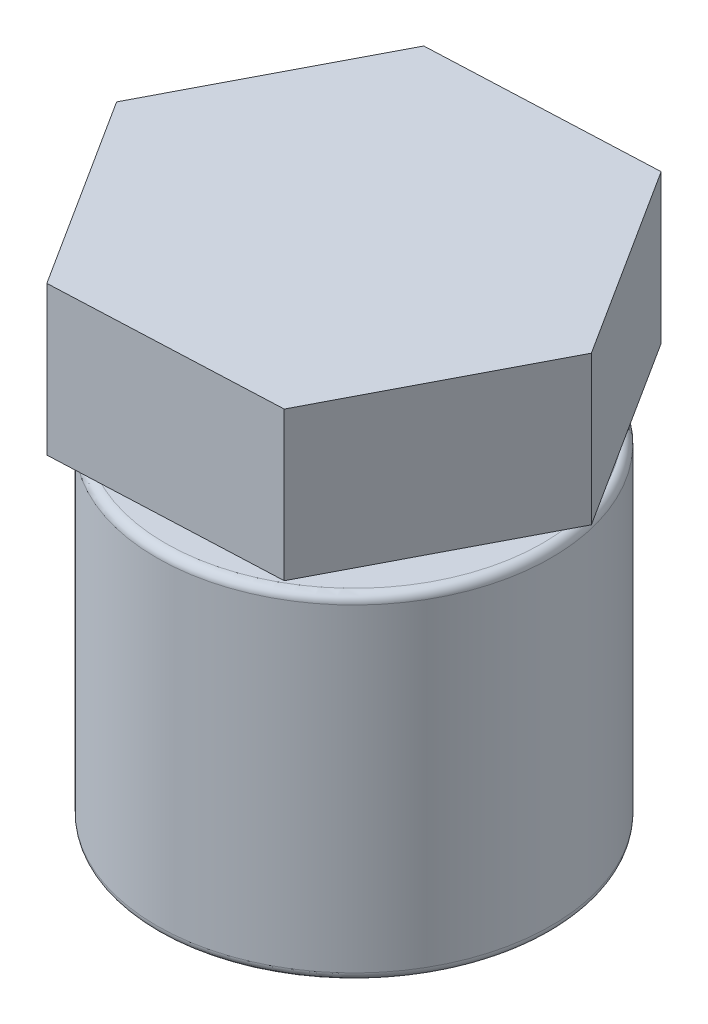
ISO-10303-21;
HEADER;
FILE_DESCRIPTION(('STEP AP214'),'2;1');
FILE_NAME('part.step','',(''),(''),'','','');
FILE_SCHEMA(('AUTOMOTIVE_DESIGN { 1 0 10303 214 1 1 1 1 }'));
ENDSEC;
DATA;
#1=APPLICATION_CONTEXT('core data for automotive mechanical design processes');
#2=APPLICATION_PROTOCOL_DEFINITION('international standard','automotive_design',2000,#1);
#3=PRODUCT_CONTEXT('',#1,'mechanical');
#4=PRODUCT('Part','Part','',(#3));
#5=PRODUCT_RELATED_PRODUCT_CATEGORY('part','',(#4));
#6=PRODUCT_DEFINITION_FORMATION('','',#4);
#7=PRODUCT_DEFINITION_CONTEXT('part definition',#1,'design');
#8=PRODUCT_DEFINITION('design','',#6,#7);
#9=PRODUCT_DEFINITION_SHAPE('','',#8);
#10=(LENGTH_UNIT() NAMED_UNIT(*) SI_UNIT(.MILLI.,.METRE.));
#11=(NAMED_UNIT(*) PLANE_ANGLE_UNIT() SI_UNIT($,.RADIAN.));
#12=(NAMED_UNIT(*) SI_UNIT($,.STERADIAN.) SOLID_ANGLE_UNIT());
#13=UNCERTAINTY_MEASURE_WITH_UNIT(LENGTH_MEASURE(1.E-05),#10,'distance_accuracy_value','');
#14=(GEOMETRIC_REPRESENTATION_CONTEXT(3) GLOBAL_UNCERTAINTY_ASSIGNED_CONTEXT((#13)) GLOBAL_UNIT_ASSIGNED_CONTEXT((#10,
#11,#12)) REPRESENTATION_CONTEXT('',''));
#15=CARTESIAN_POINT('',(0.,0.,0.));
#16=DIRECTION('',(0.,0.,1.));
#17=DIRECTION('',(1.,0.,0.));
#18=AXIS2_PLACEMENT_3D('',#15,#16,#17);
#19=CARTESIAN_POINT('',(-24.7630057131424,64.9433169628855,47.5415775502644));
#20=DIRECTION('',(-0.0433808852223487,0.,-0.999058606287602));
#21=DIRECTION('',(-0.999058606287602,0.,0.0433808852223487));
#22=AXIS2_PLACEMENT_3D('',#19,#20,#21);
#23=PLANE('',#22);
#24=DIRECTION('',(0.999058606287602,0.,-0.0433808852223487));
#25=VECTOR('',#24,1.);
#26=CARTESIAN_POINT('',(-24.7630057131424,29.9433169628855,47.5415775502644));
#27=LINE('',#26,#25);
#28=CARTESIAN_POINT('',(-24.7630057131424,29.9433169628855,47.5415775502644));
#29=VERTEX_POINT('',#28);
#30=CARTESIAN_POINT('',(28.7907110379457,29.9433169628855,45.2161807967727));
#31=VERTEX_POINT('',#30);
#32=EDGE_CURVE('E138',#29,#31,#27,.T.);
#33=ORIENTED_EDGE('',*,*,#32,.T.);
#34=DIRECTION('',(0.,-1.,0.));
#35=VECTOR('',#34,1.);
#36=CARTESIAN_POINT('',(28.7907110379457,64.9433169628855,45.2161807967727));
#37=LINE('',#36,#35);
#38=CARTESIAN_POINT('',(28.7907110379457,64.9433169628855,45.2161807967727));
#39=VERTEX_POINT('',#38);
#40=EDGE_CURVE('E12',#39,#31,#37,.T.);
#41=ORIENTED_EDGE('',*,*,#40,.F.);
#42=DIRECTION('',(0.999058606287602,0.,-0.0433808852223487));
#43=VECTOR('',#42,1.);
#44=CARTESIAN_POINT('',(-24.7630057131424,64.9433169628855,47.5415775502644));
#45=LINE('',#44,#43);
#46=CARTESIAN_POINT('',(-24.7630057131424,64.9433169628855,47.5415775502644));
#47=VERTEX_POINT('',#46);
#48=EDGE_CURVE('E155',#47,#39,#45,.T.);
#49=ORIENTED_EDGE('',*,*,#48,.F.);
#50=DIRECTION('',(0.,-1.,0.));
#51=VECTOR('',#50,1.);
#52=CARTESIAN_POINT('',(-24.7630057131424,64.9433169628855,47.5415775502644));
#53=LINE('',#52,#51);
#54=EDGE_CURVE('E134',#47,#29,#53,.T.);
#55=ORIENTED_EDGE('',*,*,#54,.T.);
#56=EDGE_LOOP('',(#33,#41,#49,#55));
#57=FACE_BOUND('',#56,.T.);
#58=ADVANCED_FACE('F49',(#57),#23,.F.);
#59=CARTESIAN_POINT('',(28.7907110379457,64.9433169628855,45.2161807967727));
#60=DIRECTION('',(-0.886900575525713,0.,-0.46196035450259));
#61=DIRECTION('',(-0.46196035450259,0.,0.886900575525714));
#62=AXIS2_PLACEMENT_3D('',#59,#60,#61);
#63=PLANE('',#62);
#64=DIRECTION('',(0.46196035450259,0.,-0.886900575525713));
#65=VECTOR('',#64,1.);
#66=CARTESIAN_POINT('',(28.7907110379457,29.9433169628855,45.2161807967727));
#67=LINE('',#66,#65);
#68=CARTESIAN_POINT('',(53.5537167510881,29.9433169628855,-2.32539675349171));
#69=VERTEX_POINT('',#68);
#70=EDGE_CURVE('E142',#31,#69,#67,.T.);
#71=ORIENTED_EDGE('',*,*,#70,.T.);
#72=DIRECTION('',(0.,-1.,0.));
#73=VECTOR('',#72,1.);
#74=CARTESIAN_POINT('',(53.5537167510881,64.9433169628855,-2.32539675349171));
#75=LINE('',#74,#73);
#76=CARTESIAN_POINT('',(53.5537167510881,64.9433169628855,-2.32539675349171));
#77=VERTEX_POINT('',#76);
#78=EDGE_CURVE('E58',#77,#69,#75,.T.);
#79=ORIENTED_EDGE('',*,*,#78,.F.);
#80=DIRECTION('',(0.46196035450259,0.,-0.886900575525713));
#81=VECTOR('',#80,1.);
#82=CARTESIAN_POINT('',(28.7907110379457,64.9433169628855,45.2161807967727));
#83=LINE('',#82,#81);
#84=EDGE_CURVE('E103',#39,#77,#83,.T.);
#85=ORIENTED_EDGE('',*,*,#84,.F.);
#86=ORIENTED_EDGE('',*,*,#40,.T.);
#87=EDGE_LOOP('',(#71,#79,#85,#86));
#88=FACE_BOUND('',#87,.T.);
#89=ADVANCED_FACE('F184',(#88),#63,.F.);
#90=CARTESIAN_POINT('',(53.5537167510881,64.9433169628855,-2.32539675349171));
#91=DIRECTION('',(-0.843519690303365,0.,0.537098251785012));
#92=DIRECTION('',(0.537098251785012,0.,0.843519690303365));
#93=AXIS2_PLACEMENT_3D('',#90,#91,#92);
#94=PLANE('',#93);
#95=DIRECTION('',(-0.537098251785012,0.,-0.843519690303364));
#96=VECTOR('',#95,1.);
#97=CARTESIAN_POINT('',(53.5537167510881,29.9433169628855,-2.32539675349171));
#98=LINE('',#97,#96);
#99=CARTESIAN_POINT('',(24.7630057131424,29.9433169628855,-47.5415775502644));
#100=VERTEX_POINT('',#99);
#101=EDGE_CURVE('E146',#69,#100,#98,.T.);
#102=ORIENTED_EDGE('',*,*,#101,.T.);
#103=DIRECTION('',(0.,-1.,0.));
#104=VECTOR('',#103,1.);
#105=CARTESIAN_POINT('',(24.7630057131424,64.9433169628855,-47.5415775502644));
#106=LINE('',#105,#104);
#107=CARTESIAN_POINT('',(24.7630057131424,64.9433169628855,-47.5415775502644));
#108=VERTEX_POINT('',#107);
#109=EDGE_CURVE('E127',#108,#100,#106,.T.);
#110=ORIENTED_EDGE('',*,*,#109,.F.);
#111=DIRECTION('',(-0.537098251785012,0.,-0.843519690303364));
#112=VECTOR('',#111,1.);
#113=CARTESIAN_POINT('',(53.5537167510881,64.9433169628855,-2.32539675349171));
#114=LINE('',#113,#112);
#115=EDGE_CURVE('E116',#77,#108,#114,.T.);
#116=ORIENTED_EDGE('',*,*,#115,.F.);
#117=ORIENTED_EDGE('',*,*,#78,.T.);
#118=EDGE_LOOP('',(#102,#110,#116,#117));
#119=FACE_BOUND('',#118,.T.);
#120=ADVANCED_FACE('F165',(#119),#94,.F.);
#121=CARTESIAN_POINT('',(24.7630057131424,64.9433169628855,-47.5415775502644));
#122=DIRECTION('',(0.0433808852223485,0.,0.999058606287602));
#123=DIRECTION('',(0.999058606287602,0.,-0.0433808852223485));
#124=AXIS2_PLACEMENT_3D('',#121,#122,#123);
#125=PLANE('',#124);
#126=DIRECTION('',(-0.999058606287602,0.,0.0433808852223485));
#127=VECTOR('',#126,1.);
#128=CARTESIAN_POINT('',(24.7630057131424,29.9433169628855,-47.5415775502644));
#129=LINE('',#128,#127);
#130=CARTESIAN_POINT('',(-28.7907110379457,29.9433169628855,-45.2161807967727));
#131=VERTEX_POINT('',#130);
#132=EDGE_CURVE('E125',#100,#131,#129,.T.);
#133=ORIENTED_EDGE('',*,*,#132,.T.);
#134=DIRECTION('',(0.,-1.,0.));
#135=VECTOR('',#134,1.);
#136=CARTESIAN_POINT('',(-28.7907110379457,64.9433169628855,-45.2161807967727));
#137=LINE('',#136,#135);
#138=CARTESIAN_POINT('',(-28.7907110379457,64.9433169628855,-45.2161807967727));
#139=VERTEX_POINT('',#138);
#140=EDGE_CURVE('E122',#139,#131,#137,.T.);
#141=ORIENTED_EDGE('',*,*,#140,.F.);
#142=DIRECTION('',(-0.999058606287602,0.,0.0433808852223485));
#143=VECTOR('',#142,1.);
#144=CARTESIAN_POINT('',(24.7630057131424,64.9433169628855,-47.5415775502644));
#145=LINE('',#144,#143);
#146=EDGE_CURVE('E110',#108,#139,#145,.T.);
#147=ORIENTED_EDGE('',*,*,#146,.F.);
#148=ORIENTED_EDGE('',*,*,#109,.T.);
#149=EDGE_LOOP('',(#133,#141,#147,#148));
#150=FACE_BOUND('',#149,.T.);
#151=ADVANCED_FACE('F123',(#150),#125,.F.);
#152=CARTESIAN_POINT('',(-28.7907110379457,64.9433169628855,-45.2161807967727));
#153=DIRECTION('',(0.886900575525713,0.,0.46196035450259));
#154=DIRECTION('',(0.46196035450259,0.,-0.886900575525713));
#155=AXIS2_PLACEMENT_3D('',#152,#153,#154);
#156=PLANE('',#155);
#157=DIRECTION('',(-0.46196035450259,0.,0.886900575525713));
#158=VECTOR('',#157,1.);
#159=CARTESIAN_POINT('',(-28.7907110379457,29.9433169628855,-45.2161807967727));
#160=LINE('',#159,#158);
#161=CARTESIAN_POINT('',(-53.5537167510881,29.9433169628855,2.3253967534917));
#162=VERTEX_POINT('',#161);
#163=EDGE_CURVE('E89',#131,#162,#160,.T.);
#164=ORIENTED_EDGE('',*,*,#163,.T.);
#165=DIRECTION('',(0.,-1.,0.));
#166=VECTOR('',#165,1.);
#167=CARTESIAN_POINT('',(-53.5537167510881,64.9433169628855,2.3253967534917));
#168=LINE('',#167,#166);
#169=CARTESIAN_POINT('',(-53.5537167510881,64.9433169628855,2.3253967534917));
#170=VERTEX_POINT('',#169);
#171=EDGE_CURVE('E128',#170,#162,#168,.T.);
#172=ORIENTED_EDGE('',*,*,#171,.F.);
#173=DIRECTION('',(-0.46196035450259,0.,0.886900575525713));
#174=VECTOR('',#173,1.);
#175=CARTESIAN_POINT('',(-28.7907110379457,64.9433169628855,-45.2161807967727));
#176=LINE('',#175,#174);
#177=EDGE_CURVE('E114',#139,#170,#176,.T.);
#178=ORIENTED_EDGE('',*,*,#177,.F.);
#179=ORIENTED_EDGE('',*,*,#140,.T.);
#180=EDGE_LOOP('',(#164,#172,#178,#179));
#181=FACE_BOUND('',#180,.T.);
#182=ADVANCED_FACE('F130',(#181),#156,.F.);
#183=CARTESIAN_POINT('',(-53.5537167510881,64.9433169628855,2.3253967534917));
#184=DIRECTION('',(0.843519690303365,0.,-0.537098251785012));
#185=DIRECTION('',(-0.537098251785012,0.,-0.843519690303365));
#186=AXIS2_PLACEMENT_3D('',#183,#184,#185);
#187=PLANE('',#186);
#188=DIRECTION('',(0.537098251785012,0.,0.843519690303365));
#189=VECTOR('',#188,1.);
#190=CARTESIAN_POINT('',(-53.5537167510881,29.9433169628855,2.3253967534917));
#191=LINE('',#190,#189);
#192=EDGE_CURVE('E95',#162,#29,#191,.T.);
#193=ORIENTED_EDGE('',*,*,#192,.T.);
#194=ORIENTED_EDGE('',*,*,#54,.F.);
#195=DIRECTION('',(0.537098251785012,0.,0.843519690303365));
#196=VECTOR('',#195,1.);
#197=CARTESIAN_POINT('',(-53.5537167510881,64.9433169628855,2.3253967534917));
#198=LINE('',#197,#196);
#199=EDGE_CURVE('E66',#170,#47,#198,.T.);
#200=ORIENTED_EDGE('',*,*,#199,.F.);
#201=ORIENTED_EDGE('',*,*,#171,.T.);
#202=EDGE_LOOP('',(#193,#194,#200,#201));
#203=FACE_BOUND('',#202,.T.);
#204=ADVANCED_FACE('F173',(#203),#187,.F.);
#205=CARTESIAN_POINT('',(0.,64.9433169628855,0.));
#206=DIRECTION('',(0.,1.,0.));
#207=DIRECTION('',(0.,0.,1.));
#208=AXIS2_PLACEMENT_3D('',#205,#206,#207);
#209=PLANE('',#208);
#210=ORIENTED_EDGE('',*,*,#48,.T.);
#211=ORIENTED_EDGE('',*,*,#84,.T.);
#212=ORIENTED_EDGE('',*,*,#115,.T.);
#213=ORIENTED_EDGE('',*,*,#146,.T.);
#214=ORIENTED_EDGE('',*,*,#177,.T.);
#215=ORIENTED_EDGE('',*,*,#199,.T.);
#216=EDGE_LOOP('',(#210,#211,#212,#213,#214,#215));
#217=FACE_BOUND('',#216,.T.);
#218=ADVANCED_FACE('F112',(#217),#209,.T.);
#219=CARTESIAN_POINT('',(0.,29.9433169628855,0.));
#220=DIRECTION('',(0.,1.,0.));
#221=DIRECTION('',(0.,0.,1.));
#222=AXIS2_PLACEMENT_3D('',#219,#220,#221);
#223=PLANE('',#222);
#224=ORIENTED_EDGE('',*,*,#32,.F.);
#225=ORIENTED_EDGE('',*,*,#192,.F.);
#226=ORIENTED_EDGE('',*,*,#163,.F.);
#227=ORIENTED_EDGE('',*,*,#132,.F.);
#228=ORIENTED_EDGE('',*,*,#101,.F.);
#229=ORIENTED_EDGE('',*,*,#70,.F.);
#230=EDGE_LOOP('',(#224,#225,#226,#227,#228,#229));
#231=FACE_BOUND('',#230,.T.);
#232=CARTESIAN_POINT('',(0.,29.9433169628855,0.));
#233=DIRECTION('',(0.,-1.,0.));
#234=DIRECTION('',(0.,0.,-1.));
#235=AXIS2_PLACEMENT_3D('',#232,#233,#234);
#236=CIRCLE('',#235,14.2525468287873);
#237=CARTESIAN_POINT('',(0.,29.9433169628855,-14.2525468287873));
#238=VERTEX_POINT('',#237);
#239=EDGE_CURVE('E295',#238,#238,#236,.T.);
#240=ORIENTED_EDGE('',*,*,#239,.F.);
#241=EDGE_LOOP('',(#240));
#242=FACE_BOUND('',#241,.T.);
#243=ADVANCED_FACE('F168',(#231,#242),#223,.F.);
#244=CARTESIAN_POINT('',(0.,51.3091685836346,0.));
#245=DIRECTION('',(0.,1.,0.));
#246=DIRECTION('',(0.,0.,1.));
#247=AXIS2_PLACEMENT_3D('',#244,#245,#246);
#248=PLANE('',#247);
#249=CARTESIAN_POINT('',(0.,51.3091685836346,0.));
#250=DIRECTION('',(0.,-1.,0.));
#251=DIRECTION('',(0.,0.,-1.));
#252=AXIS2_PLACEMENT_3D('',#249,#250,#251);
#253=CIRCLE('',#252,9.36595934463169);
#254=CARTESIAN_POINT('',(0.,51.3091685836346,-9.36595934463169));
#255=VERTEX_POINT('',#254);
#256=EDGE_CURVE('E143',#255,#255,#253,.T.);
#257=ORIENTED_EDGE('',*,*,#256,.T.);
#258=EDGE_LOOP('',(#257));
#259=FACE_BOUND('',#258,.T.);
#260=ADVANCED_FACE('F246',(#259),#248,.F.);
#261=CARTESIAN_POINT('',(0.,17.5102718182245,0.));
#262=DIRECTION('',(0.,-1.,0.));
#263=DIRECTION('',(0.,0.,-1.));
#264=AXIS2_PLACEMENT_3D('',#261,#262,#263);
#265=CYLINDRICAL_SURFACE('',#264,9.36595934463169);
#266=ORIENTED_EDGE('',*,*,#256,.F.);
#267=EDGE_LOOP('',(#266));
#268=FACE_BOUND('',#267,.T.);
#269=CARTESIAN_POINT('',(0.,43.1648561100418,0.));
#270=DIRECTION('',(0.,-1.,0.));
#271=DIRECTION('',(0.,0.,-1.));
#272=AXIS2_PLACEMENT_3D('',#269,#270,#271);
#273=CIRCLE('',#272,9.36595934463169);
#274=CARTESIAN_POINT('',(0.,43.1648561100418,-9.36595934463169));
#275=VERTEX_POINT('',#274);
#276=EDGE_CURVE('E299',#275,#275,#273,.T.);
#277=ORIENTED_EDGE('',*,*,#276,.T.);
#278=EDGE_LOOP('',(#277));
#279=FACE_BOUND('',#278,.T.);
#280=ADVANCED_FACE('F253',(#268,#279),#265,.F.);
#281=CARTESIAN_POINT('',(9.36595934463169,43.1648561100418,0.));
#282=DIRECTION('',(0.,1.,0.));
#283=DIRECTION('',(0.,0.,1.));
#284=AXIS2_PLACEMENT_3D('',#281,#282,#283);
#285=PLANE('',#284);
#286=ORIENTED_EDGE('',*,*,#276,.F.);
#287=EDGE_LOOP('',(#286));
#288=FACE_BOUND('',#287,.T.);
#289=CARTESIAN_POINT('',(0.,43.1648561100418,0.));
#290=DIRECTION('',(0.,-1.,0.));
#291=DIRECTION('',(0.,0.,-1.));
#292=AXIS2_PLACEMENT_3D('',#289,#290,#291);
#293=CIRCLE('',#292,14.2525468287873);
#294=CARTESIAN_POINT('',(0.,43.1648561100418,-14.2525468287873));
#295=VERTEX_POINT('',#294);
#296=EDGE_CURVE('E292',#295,#295,#293,.T.);
#297=ORIENTED_EDGE('',*,*,#296,.T.);
#298=EDGE_LOOP('',(#297));
#299=FACE_BOUND('',#298,.T.);
#300=ADVANCED_FACE('F262',(#288,#299),#285,.F.);
#301=CARTESIAN_POINT('',(0.,17.5102718182245,0.));
#302=DIRECTION('',(0.,-1.,0.));
#303=DIRECTION('',(0.,0.,-1.));
#304=AXIS2_PLACEMENT_3D('',#301,#302,#303);
#305=CYLINDRICAL_SURFACE('',#304,14.2525468287873);
#306=ORIENTED_EDGE('',*,*,#296,.F.);
#307=EDGE_LOOP('',(#306));
#308=FACE_BOUND('',#307,.T.);
#309=ORIENTED_EDGE('',*,*,#239,.T.);
#310=EDGE_LOOP('',(#309));
#311=FACE_BOUND('',#310,.T.);
#312=ADVANCED_FACE('F271',(#308,#311),#305,.F.);
#313=CLOSED_SHELL('',(#58,#89,#120,#151,#182,#204,#218,#243,#260,#280,#300,#312));
#314=MANIFOLD_SOLID_BREP('B2',#313);
#315=CARTESIAN_POINT('',(0.,51.3091685836346,0.));
#316=DIRECTION('',(0.,1.,0.));
#317=DIRECTION('',(0.,0.,1.));
#318=AXIS2_PLACEMENT_3D('',#315,#316,#317);
#319=PLANE('',#318);
#320=CARTESIAN_POINT('',(0.,51.3091685836346,0.));
#321=DIRECTION('',(0.,-1.,0.));
#322=DIRECTION('',(0.,0.,-1.));
#323=AXIS2_PLACEMENT_3D('',#320,#321,#322);
#324=CIRCLE('',#323,9.36595934463169);
#325=CARTESIAN_POINT('',(0.,51.3091685836346,-9.36595934463169));
#326=VERTEX_POINT('',#325);
#327=EDGE_CURVE('E345',#326,#326,#324,.T.);
#328=ORIENTED_EDGE('',*,*,#327,.F.);
#329=EDGE_LOOP('',(#328));
#330=FACE_BOUND('',#329,.T.);
#331=ADVANCED_FACE('F324',(#330),#319,.T.);
#332=CARTESIAN_POINT('',(0.,17.5102718182245,0.));
#333=DIRECTION('',(0.,-1.,0.));
#334=DIRECTION('',(0.,0.,-1.));
#335=AXIS2_PLACEMENT_3D('',#332,#333,#334);
#336=CYLINDRICAL_SURFACE('',#335,9.36595934463169);
#337=ORIENTED_EDGE('',*,*,#327,.T.);
#338=EDGE_LOOP('',(#337));
#339=FACE_BOUND('',#338,.T.);
#340=CARTESIAN_POINT('',(0.,43.1648561100418,0.));
#341=DIRECTION('',(0.,-1.,0.));
#342=DIRECTION('',(0.,0.,-1.));
#343=AXIS2_PLACEMENT_3D('',#340,#341,#342);
#344=CIRCLE('',#343,9.36595934463169);
#345=CARTESIAN_POINT('',(0.,43.1648561100418,-9.36595934463169));
#346=VERTEX_POINT('',#345);
#347=EDGE_CURVE('E348',#346,#346,#344,.T.);
#348=ORIENTED_EDGE('',*,*,#347,.F.);
#349=EDGE_LOOP('',(#348));
#350=FACE_BOUND('',#349,.T.);
#351=ADVANCED_FACE('F426',(#339,#350),#336,.T.);
#352=CARTESIAN_POINT('',(9.36595934463169,43.1648561100418,0.));
#353=DIRECTION('',(0.,1.,0.));
#354=DIRECTION('',(0.,0.,1.));
#355=AXIS2_PLACEMENT_3D('',#352,#353,#354);
#356=PLANE('',#355);
#357=ORIENTED_EDGE('',*,*,#347,.T.);
#358=EDGE_LOOP('',(#357));
#359=FACE_BOUND('',#358,.T.);
#360=CARTESIAN_POINT('',(0.,43.1648561100418,0.));
#361=DIRECTION('',(0.,-1.,0.));
#362=DIRECTION('',(0.,0.,-1.));
#363=AXIS2_PLACEMENT_3D('',#360,#361,#362);
#364=CIRCLE('',#363,14.2525468287873);
#365=CARTESIAN_POINT('',(0.,43.1648561100418,-14.2525468287873));
#366=VERTEX_POINT('',#365);
#367=EDGE_CURVE('E351',#366,#366,#364,.T.);
#368=ORIENTED_EDGE('',*,*,#367,.F.);
#369=EDGE_LOOP('',(#368));
#370=FACE_BOUND('',#369,.T.);
#371=ADVANCED_FACE('F422',(#359,#370),#356,.T.);
#372=CARTESIAN_POINT('',(0.,17.5102718182245,0.));
#373=DIRECTION('',(0.,-1.,0.));
#374=DIRECTION('',(0.,0.,-1.));
#375=AXIS2_PLACEMENT_3D('',#372,#373,#374);
#376=CYLINDRICAL_SURFACE('',#375,14.2525468287873);
#377=ORIENTED_EDGE('',*,*,#367,.T.);
#378=EDGE_LOOP('',(#377));
#379=FACE_BOUND('',#378,.T.);
#380=CARTESIAN_POINT('',(0.,29.9433169628855,0.));
#381=DIRECTION('',(0.,-1.,0.));
#382=DIRECTION('',(0.,0.,-1.));
#383=AXIS2_PLACEMENT_3D('',#380,#381,#382);
#384=CIRCLE('',#383,14.2525468287873);
#385=CARTESIAN_POINT('',(0.,29.9433169628855,-14.2525468287873));
#386=VERTEX_POINT('',#385);
#387=EDGE_CURVE('E354',#386,#386,#384,.T.);
#388=ORIENTED_EDGE('',*,*,#387,.F.);
#389=EDGE_LOOP('',(#388));
#390=FACE_BOUND('',#389,.T.);
#391=ADVANCED_FACE('F418',(#379,#390),#376,.T.);
#392=CARTESIAN_POINT('',(14.2525468287873,29.9433169628855,0.));
#393=DIRECTION('',(0.,1.,0.));
#394=DIRECTION('',(0.,0.,1.));
#395=AXIS2_PLACEMENT_3D('',#392,#393,#394);
#396=PLANE('',#395);
#397=ORIENTED_EDGE('',*,*,#387,.T.);
#398=EDGE_LOOP('',(#397));
#399=FACE_BOUND('',#398,.T.);
#400=CARTESIAN_POINT('',(0.,29.9433169628855,0.));
#401=DIRECTION('',(0.,-1.,0.));
#402=DIRECTION('',(0.,0.,-1.));
#403=AXIS2_PLACEMENT_3D('',#400,#401,#402);
#404=CIRCLE('',#403,14.8970263545607);
#405=CARTESIAN_POINT('',(0.,29.9433169628855,-14.8970263545607));
#406=VERTEX_POINT('',#405);
#407=EDGE_CURVE('E357',#406,#406,#404,.T.);
#408=ORIENTED_EDGE('',*,*,#407,.F.);
#409=EDGE_LOOP('',(#408));
#410=FACE_BOUND('',#409,.T.);
#411=ADVANCED_FACE('F414',(#399,#410),#396,.T.);
#412=CARTESIAN_POINT('',(0.,17.5102718182245,0.));
#413=DIRECTION('',(0.,-1.,0.));
#414=DIRECTION('',(0.,0.,-1.));
#415=AXIS2_PLACEMENT_3D('',#412,#413,#414);
#416=CYLINDRICAL_SURFACE('',#415,14.8970263545607);
#417=ORIENTED_EDGE('',*,*,#407,.T.);
#418=EDGE_LOOP('',(#417));
#419=FACE_BOUND('',#418,.T.);
#420=CARTESIAN_POINT('',(0.,28.9123092812544,0.));
#421=DIRECTION('',(0.,-1.,0.));
#422=DIRECTION('',(0.,0.,-1.));
#423=AXIS2_PLACEMENT_3D('',#420,#421,#422);
#424=CIRCLE('',#423,14.8970263545607);
#425=CARTESIAN_POINT('',(0.,28.9123092812544,-14.8970263545607));
#426=VERTEX_POINT('',#425);
#427=EDGE_CURVE('E360',#426,#426,#424,.T.);
#428=ORIENTED_EDGE('',*,*,#427,.F.);
#429=EDGE_LOOP('',(#428));
#430=FACE_BOUND('',#429,.T.);
#431=ADVANCED_FACE('F410',(#419,#430),#416,.T.);
#432=CARTESIAN_POINT('',(14.8970263545607,28.9123092812544,0.));
#433=DIRECTION('',(0.,-1.,0.));
#434=DIRECTION('',(0.,0.,-1.));
#435=AXIS2_PLACEMENT_3D('',#432,#433,#434);
#436=PLANE('',#435);
#437=ORIENTED_EDGE('',*,*,#427,.T.);
#438=EDGE_LOOP('',(#437));
#439=FACE_BOUND('',#438,.T.);
#440=CARTESIAN_POINT('',(0.,28.9123092812544,0.));
#441=DIRECTION('',(0.,-1.,0.));
#442=DIRECTION('',(0.,0.,-1.));
#443=AXIS2_PLACEMENT_3D('',#440,#441,#442);
#444=CIRCLE('',#443,14.2525468287873);
#445=CARTESIAN_POINT('',(0.,28.9123092812544,-14.2525468287873));
#446=VERTEX_POINT('',#445);
#447=EDGE_CURVE('E363',#446,#446,#444,.T.);
#448=ORIENTED_EDGE('',*,*,#447,.F.);
#449=EDGE_LOOP('',(#448));
#450=FACE_BOUND('',#449,.T.);
#451=ADVANCED_FACE('F406',(#439,#450),#436,.T.);
#452=CARTESIAN_POINT('',(0.,17.5102718182245,0.));
#453=DIRECTION('',(0.,-1.,0.));
#454=DIRECTION('',(0.,0.,-1.));
#455=AXIS2_PLACEMENT_3D('',#452,#453,#454);
#456=CYLINDRICAL_SURFACE('',#455,14.2525468287873);
#457=ORIENTED_EDGE('',*,*,#447,.T.);
#458=EDGE_LOOP('',(#457));
#459=FACE_BOUND('',#458,.T.);
#460=CARTESIAN_POINT('',(0.,22.8040749260598,0.));
#461=DIRECTION('',(0.,-1.,0.));
#462=DIRECTION('',(0.,0.,-1.));
#463=AXIS2_PLACEMENT_3D('',#460,#461,#462);
#464=CIRCLE('',#463,14.2525468287873);
#465=CARTESIAN_POINT('',(0.,22.8040749260598,-14.2525468287873));
#466=VERTEX_POINT('',#465);
#467=EDGE_CURVE('E366',#466,#466,#464,.T.);
#468=ORIENTED_EDGE('',*,*,#467,.F.);
#469=EDGE_LOOP('',(#468));
#470=FACE_BOUND('',#469,.T.);
#471=ADVANCED_FACE('F403',(#459,#470),#456,.T.);
#472=CARTESIAN_POINT('',(14.2525468287873,22.8040749260598,0.));
#473=DIRECTION('',(0.,1.,0.));
#474=DIRECTION('',(0.,0.,1.));
#475=AXIS2_PLACEMENT_3D('',#472,#473,#474);
#476=PLANE('',#475);
#477=CARTESIAN_POINT('',(0.,22.8040749260598,0.));
#478=DIRECTION('',(0.,1.,0.));
#479=DIRECTION('',(0.,0.,1.));
#480=AXIS2_PLACEMENT_3D('',#477,#478,#479);
#481=CIRCLE('',#480,44.4225810994789);
#482=CARTESIAN_POINT('',(0.,22.8040749260598,44.4225810994789));
#483=VERTEX_POINT('',#482);
#484=EDGE_CURVE('E48',#483,#483,#481,.T.);
#485=ORIENTED_EDGE('',*,*,#484,.T.);
#486=EDGE_LOOP('',(#485));
#487=FACE_BOUND('',#486,.T.);
#488=ORIENTED_EDGE('',*,*,#467,.T.);
#489=EDGE_LOOP('',(#488));
#490=FACE_BOUND('',#489,.T.);
#491=ADVANCED_FACE('F400',(#487,#490),#476,.T.);
#492=CARTESIAN_POINT('',(0.,17.5102718182245,0.));
#493=DIRECTION('',(0.,-1.,0.));
#494=DIRECTION('',(0.,0.,-1.));
#495=AXIS2_PLACEMENT_3D('',#492,#493,#494);
#496=CYLINDRICAL_SURFACE('',#495,46.4225810994789);
#497=CARTESIAN_POINT('',(0.,-54.1957560677903,0.));
#498=DIRECTION('',(0.,-1.,0.));
#499=DIRECTION('',(0.,0.,-1.));
#500=AXIS2_PLACEMENT_3D('',#497,#498,#499);
#501=CIRCLE('',#500,46.4225810994789);
#502=CARTESIAN_POINT('',(0.,-54.1957560677903,-46.4225810994789));
#503=VERTEX_POINT('',#502);
#504=EDGE_CURVE('E332',#503,#503,#501,.F.);
#505=ORIENTED_EDGE('',*,*,#504,.T.);
#506=EDGE_LOOP('',(#505));
#507=FACE_BOUND('',#506,.T.);
#508=CARTESIAN_POINT('',(0.,20.8040749260598,0.));
#509=DIRECTION('',(0.,1.,0.));
#510=DIRECTION('',(0.,0.,1.));
#511=AXIS2_PLACEMENT_3D('',#508,#509,#510);
#512=CIRCLE('',#511,46.4225810994789);
#513=CARTESIAN_POINT('',(0.,20.8040749260598,46.4225810994789));
#514=VERTEX_POINT('',#513);
#515=EDGE_CURVE('E336',#514,#514,#512,.F.);
#516=ORIENTED_EDGE('',*,*,#515,.T.);
#517=EDGE_LOOP('',(#516));
#518=FACE_BOUND('',#517,.T.);
#519=ADVANCED_FACE('F396',(#507,#518),#496,.T.);
#520=CARTESIAN_POINT('',(46.4225810994789,-56.1957560677903,0.));
#521=DIRECTION('',(0.,-1.,0.));
#522=DIRECTION('',(0.,0.,-1.));
#523=AXIS2_PLACEMENT_3D('',#520,#521,#522);
#524=PLANE('',#523);
#525=CARTESIAN_POINT('',(0.,-56.1957560677903,0.));
#526=DIRECTION('',(0.,-1.,0.));
#527=DIRECTION('',(0.,0.,-1.));
#528=AXIS2_PLACEMENT_3D('',#525,#526,#527);
#529=CIRCLE('',#528,44.4225810994789);
#530=CARTESIAN_POINT('',(0.,-56.1957560677903,-44.4225810994789));
#531=VERTEX_POINT('',#530);
#532=EDGE_CURVE('E340',#531,#531,#529,.T.);
#533=ORIENTED_EDGE('',*,*,#532,.T.);
#534=EDGE_LOOP('',(#533));
#535=FACE_BOUND('',#534,.T.);
#536=ADVANCED_FACE('F392',(#535),#524,.T.);
#537=CARTESIAN_POINT('',(0.,-54.1957560677903,0.));
#538=DIRECTION('',(0.,-1.,0.));
#539=DIRECTION('',(0.,0.,-1.));
#540=AXIS2_PLACEMENT_3D('',#537,#538,#539);
#541=TOROIDAL_SURFACE('',#540,44.4225810994789,2.);
#542=ORIENTED_EDGE('',*,*,#504,.F.);
#543=EDGE_LOOP('',(#542));
#544=FACE_BOUND('',#543,.T.);
#545=ORIENTED_EDGE('',*,*,#532,.F.);
#546=EDGE_LOOP('',(#545));
#547=FACE_BOUND('',#546,.T.);
#548=ADVANCED_FACE('F395',(#544,#547),#541,.T.);
#549=CARTESIAN_POINT('',(0.,20.8040749260598,0.));
#550=DIRECTION('',(0.,1.,0.));
#551=DIRECTION('',(0.,0.,1.));
#552=AXIS2_PLACEMENT_3D('',#549,#550,#551);
#553=TOROIDAL_SURFACE('',#552,44.4225810994789,2.);
#554=ORIENTED_EDGE('',*,*,#484,.F.);
#555=EDGE_LOOP('',(#554));
#556=FACE_BOUND('',#555,.T.);
#557=ORIENTED_EDGE('',*,*,#515,.F.);
#558=EDGE_LOOP('',(#557));
#559=FACE_BOUND('',#558,.T.);
#560=ADVANCED_FACE('F326',(#556,#559),#553,.T.);
#561=CLOSED_SHELL('',(#331,#351,#371,#391,#411,#431,#451,#471,#491,#519,#536,#548,#560));
#562=CARTESIAN_POINT('',(0.,-43.9792873574011,0.));
#563=DIRECTION('',(0.,1.,0.));
#564=DIRECTION('',(0.,0.,1.));
#565=AXIS2_PLACEMENT_3D('',#562,#563,#564);
#566=PLANE('',#565);
#567=CARTESIAN_POINT('',(0.,-43.9792873574011,0.));
#568=DIRECTION('',(0.,-1.,0.));
#569=DIRECTION('',(0.,0.,-1.));
#570=AXIS2_PLACEMENT_3D('',#567,#568,#569);
#571=CIRCLE('',#570,42.3504248626825);
#572=CARTESIAN_POINT('',(0.,-43.9792873574011,-42.3504248626825));
#573=VERTEX_POINT('',#572);
#574=EDGE_CURVE('E369',#573,#573,#571,.T.);
#575=ORIENTED_EDGE('',*,*,#574,.F.);
#576=EDGE_LOOP('',(#575));
#577=FACE_BOUND('',#576,.T.);
#578=ADVANCED_FACE('F380',(#577),#566,.T.);
#579=CARTESIAN_POINT('',(0.,17.5102718182245,0.));
#580=DIRECTION('',(0.,-1.,0.));
#581=DIRECTION('',(0.,0.,-1.));
#582=AXIS2_PLACEMENT_3D('',#579,#580,#581);
#583=CYLINDRICAL_SURFACE('',#582,42.3504248626825);
#584=ORIENTED_EDGE('',*,*,#574,.T.);
#585=EDGE_LOOP('',(#584));
#586=FACE_BOUND('',#585,.T.);
#587=CARTESIAN_POINT('',(0.,17.5102718182245,0.));
#588=DIRECTION('',(0.,-1.,0.));
#589=DIRECTION('',(0.,0.,-1.));
#590=AXIS2_PLACEMENT_3D('',#587,#588,#589);
#591=CIRCLE('',#590,42.3504248626825);
#592=CARTESIAN_POINT('',(0.,17.5102718182245,-42.3504248626825));
#593=VERTEX_POINT('',#592);
#594=EDGE_CURVE('E372',#593,#593,#591,.T.);
#595=ORIENTED_EDGE('',*,*,#594,.F.);
#596=EDGE_LOOP('',(#595));
#597=FACE_BOUND('',#596,.T.);
#598=ADVANCED_FACE('F378',(#586,#597),#583,.F.);
#599=CARTESIAN_POINT('',(42.3504248626825,17.5102718182245,0.));
#600=DIRECTION('',(0.,-1.,0.));
#601=DIRECTION('',(0.,0.,-1.));
#602=AXIS2_PLACEMENT_3D('',#599,#600,#601);
#603=PLANE('',#602);
#604=ORIENTED_EDGE('',*,*,#594,.T.);
#605=EDGE_LOOP('',(#604));
#606=FACE_BOUND('',#605,.T.);
#607=ADVANCED_FACE('F376',(#606),#603,.T.);
#608=CLOSED_SHELL('',(#578,#598,#607));
#609=ORIENTED_CLOSED_SHELL('',*,#608,.T.);
#610=BREP_WITH_VOIDS('B6',#561,(#609));
#611=ADVANCED_BREP_SHAPE_REPRESENTATION('',(#18,#314,#610),#14);
#612=SHAPE_DEFINITION_REPRESENTATION(#9,#611);
ENDSEC;
END-ISO-10303-21;
